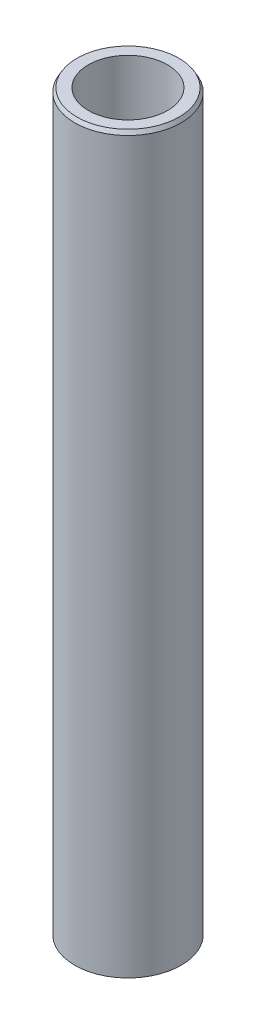
ISO-10303-21;
HEADER;
FILE_DESCRIPTION(('STEP AP214'),'2;1');
FILE_NAME('part.step','',(''),(''),'','','');
FILE_SCHEMA(('AUTOMOTIVE_DESIGN { 1 0 10303 214 1 1 1 1 }'));
ENDSEC;
DATA;
#1=APPLICATION_CONTEXT('core data for automotive mechanical design processes');
#2=APPLICATION_PROTOCOL_DEFINITION('international standard','automotive_design',2000,#1);
#3=PRODUCT_CONTEXT('',#1,'mechanical');
#4=PRODUCT('Part','Part','',(#3));
#5=PRODUCT_RELATED_PRODUCT_CATEGORY('part','',(#4));
#6=PRODUCT_DEFINITION_FORMATION('','',#4);
#7=PRODUCT_DEFINITION_CONTEXT('part definition',#1,'design');
#8=PRODUCT_DEFINITION('design','',#6,#7);
#9=PRODUCT_DEFINITION_SHAPE('','',#8);
#10=(LENGTH_UNIT() NAMED_UNIT(*) SI_UNIT(.MILLI.,.METRE.));
#11=(NAMED_UNIT(*) PLANE_ANGLE_UNIT() SI_UNIT($,.RADIAN.));
#12=(NAMED_UNIT(*) SI_UNIT($,.STERADIAN.) SOLID_ANGLE_UNIT());
#13=UNCERTAINTY_MEASURE_WITH_UNIT(LENGTH_MEASURE(1.E-05),#10,'distance_accuracy_value','');
#14=(GEOMETRIC_REPRESENTATION_CONTEXT(3) GLOBAL_UNCERTAINTY_ASSIGNED_CONTEXT((#13)) GLOBAL_UNIT_ASSIGNED_CONTEXT((#10,
#11,#12)) REPRESENTATION_CONTEXT('',''));
#15=CARTESIAN_POINT('',(0.,0.,0.));
#16=DIRECTION('',(0.,0.,1.));
#17=DIRECTION('',(1.,0.,0.));
#18=AXIS2_PLACEMENT_3D('',#15,#16,#17);
#19=CARTESIAN_POINT('',(0.,518.320670066875,0.));
#20=DIRECTION('',(0.,-1.,0.));
#21=DIRECTION('',(0.,0.,-1.));
#22=AXIS2_PLACEMENT_3D('',#19,#20,#21);
#23=CYLINDRICAL_SURFACE('',#22,37.5);
#24=CARTESIAN_POINT('',(0.,515.602855716314,0.));
#25=DIRECTION('',(0.,1.,0.));
#26=DIRECTION('',(0.,0.,1.));
#27=AXIS2_PLACEMENT_3D('',#24,#25,#26);
#28=CIRCLE('',#27,37.5);
#29=CARTESIAN_POINT('',(0.,515.602855716314,37.5));
#30=VERTEX_POINT('',#29);
#31=EDGE_CURVE('E50',#30,#30,#28,.F.);
#32=ORIENTED_EDGE('',*,*,#31,.T.);
#33=EDGE_LOOP('',(#32));
#34=FACE_BOUND('',#33,.T.);
#35=CARTESIAN_POINT('',(0.,1.56913084690324,0.));
#36=DIRECTION('',(0.,1.,0.));
#37=DIRECTION('',(0.,0.,1.));
#38=AXIS2_PLACEMENT_3D('',#35,#36,#37);
#39=CIRCLE('',#38,37.5);
#40=CARTESIAN_POINT('',(0.,1.56913084690324,37.5));
#41=VERTEX_POINT('',#40);
#42=EDGE_CURVE('E51',#41,#41,#39,.T.);
#43=ORIENTED_EDGE('',*,*,#42,.T.);
#44=EDGE_LOOP('',(#43));
#45=FACE_BOUND('',#44,.T.);
#46=ADVANCED_FACE('F39',(#34,#45),#23,.T.);
#47=CARTESIAN_POINT('',(0.,518.320670066875,0.));
#48=DIRECTION('',(0.,1.,0.));
#49=DIRECTION('',(0.,0.,1.));
#50=AXIS2_PLACEMENT_3D('',#47,#48,#49);
#51=PLANE('',#50);
#52=CARTESIAN_POINT('',(0.,518.320670066875,0.));
#53=DIRECTION('',(0.,1.,0.));
#54=DIRECTION('',(0.,0.,1.));
#55=AXIS2_PLACEMENT_3D('',#52,#53,#54);
#56=CIRCLE('',#55,35.9308691530967);
#57=CARTESIAN_POINT('',(0.,518.320670066875,35.9308691530967));
#58=VERTEX_POINT('',#57);
#59=EDGE_CURVE('E54',#58,#58,#56,.T.);
#60=ORIENTED_EDGE('',*,*,#59,.T.);
#61=EDGE_LOOP('',(#60));
#62=FACE_BOUND('',#61,.T.);
#63=CARTESIAN_POINT('',(0.,518.320670066875,0.));
#64=DIRECTION('',(0.,1.,0.));
#65=DIRECTION('',(0.,0.,1.));
#66=AXIS2_PLACEMENT_3D('',#63,#64,#65);
#67=CIRCLE('',#66,27.924179859783);
#68=CARTESIAN_POINT('',(0.,518.320670066875,27.924179859783));
#69=VERTEX_POINT('',#68);
#70=EDGE_CURVE('E58',#69,#69,#67,.T.);
#71=ORIENTED_EDGE('',*,*,#70,.F.);
#72=EDGE_LOOP('',(#71));
#73=FACE_BOUND('',#72,.T.);
#74=ADVANCED_FACE('F69',(#62,#73),#51,.T.);
#75=CARTESIAN_POINT('',(0.,0.,0.));
#76=DIRECTION('',(0.,1.,0.));
#77=DIRECTION('',(0.,0.,1.));
#78=AXIS2_PLACEMENT_3D('',#75,#76,#77);
#79=PLANE('',#78);
#80=CARTESIAN_POINT('',(0.,0.,0.));
#81=DIRECTION('',(0.,1.,0.));
#82=DIRECTION('',(0.,0.,1.));
#83=AXIS2_PLACEMENT_3D('',#80,#81,#82);
#84=CIRCLE('',#83,34.78218564944);
#85=CARTESIAN_POINT('',(0.,0.,34.78218564944));
#86=VERTEX_POINT('',#85);
#87=EDGE_CURVE('E10',#86,#86,#84,.F.);
#88=ORIENTED_EDGE('',*,*,#87,.T.);
#89=EDGE_LOOP('',(#88));
#90=FACE_BOUND('',#89,.T.);
#91=CARTESIAN_POINT('',(0.,0.,0.));
#92=DIRECTION('',(0.,1.,0.));
#93=DIRECTION('',(0.,0.,1.));
#94=AXIS2_PLACEMENT_3D('',#91,#92,#93);
#95=CIRCLE('',#94,27.924179859783);
#96=CARTESIAN_POINT('',(0.,0.,27.924179859783));
#97=VERTEX_POINT('',#96);
#98=EDGE_CURVE('E63',#97,#97,#95,.T.);
#99=ORIENTED_EDGE('',*,*,#98,.T.);
#100=EDGE_LOOP('',(#99));
#101=FACE_BOUND('',#100,.T.);
#102=ADVANCED_FACE('F75',(#90,#101),#79,.F.);
#103=CARTESIAN_POINT('',(0.,518.320670066875,0.));
#104=DIRECTION('',(0.,-1.,0.));
#105=DIRECTION('',(0.,0.,-1.));
#106=AXIS2_PLACEMENT_3D('',#103,#104,#105);
#107=CYLINDRICAL_SURFACE('',#106,27.924179859783);
#108=ORIENTED_EDGE('',*,*,#70,.T.);
#109=EDGE_LOOP('',(#108));
#110=FACE_BOUND('',#109,.T.);
#111=ORIENTED_EDGE('',*,*,#98,.F.);
#112=EDGE_LOOP('',(#111));
#113=FACE_BOUND('',#112,.T.);
#114=ADVANCED_FACE('F70',(#110,#113),#107,.F.);
#115=CARTESIAN_POINT('',(0.,518.320670066875,0.));
#116=DIRECTION('',(0.,-1.,0.));
#117=DIRECTION('',(0.,0.,-1.));
#118=AXIS2_PLACEMENT_3D('',#115,#116,#117);
#119=CONICAL_SURFACE('',#118,35.9308691530967,0.523598775598294);
#120=ORIENTED_EDGE('',*,*,#31,.F.);
#121=EDGE_LOOP('',(#120));
#122=FACE_BOUND('',#121,.T.);
#123=ORIENTED_EDGE('',*,*,#59,.F.);
#124=EDGE_LOOP('',(#123));
#125=FACE_BOUND('',#124,.T.);
#126=ADVANCED_FACE('F81',(#122,#125),#119,.T.);
#127=CARTESIAN_POINT('',(0.,1.56913084690324,0.));
#128=DIRECTION('',(0.,1.,0.));
#129=DIRECTION('',(0.,0.,1.));
#130=AXIS2_PLACEMENT_3D('',#127,#128,#129);
#131=CONICAL_SURFACE('',#130,37.5,1.0471975511966);
#132=CARTESIAN_POINT('',(0.,0.,34.78218564944));
#133=CARTESIAN_POINT('',(0.,0.0163451129885766,34.8104962155916));
#134=CARTESIAN_POINT('',(0.,0.0326902259771516,34.8388067817433));
#135=CARTESIAN_POINT('',(0.,0.0653804519543017,34.8954279140466));
#136=CARTESIAN_POINT('',(0.,0.0817255649428767,34.9237384801983));
#137=CARTESIAN_POINT('',(0.,0.114415790920027,34.9803596125016));
#138=CARTESIAN_POINT('',(0.,0.130760903908603,35.0086701786533));
#139=CARTESIAN_POINT('',(0.,0.163451129885755,35.0652913109566));
#140=CARTESIAN_POINT('',(0.,0.179796242874331,35.0936018771083));
#141=CARTESIAN_POINT('',(0.,0.212486468851481,35.1502230094116));
#142=CARTESIAN_POINT('',(0.,0.228831581840056,35.1785335755633));
#143=CARTESIAN_POINT('',(0.,0.261521807817207,35.2351547078666));
#144=CARTESIAN_POINT('',(0.,0.277866920805783,35.2634652740183));
#145=CARTESIAN_POINT('',(0.,0.310557146782934,35.3200864063216));
#146=CARTESIAN_POINT('',(0.,0.326902259771509,35.3483969724733));
#147=CARTESIAN_POINT('',(0.,0.359592485748659,35.4050181047766));
#148=CARTESIAN_POINT('',(0.,0.375937598737235,35.4333286709283));
#149=CARTESIAN_POINT('',(0.,0.408627824714387,35.4899498032316));
#150=CARTESIAN_POINT('',(0.,0.424972937702962,35.5182603693833));
#151=CARTESIAN_POINT('',(0.,0.457663163680113,35.5748815016866));
#152=CARTESIAN_POINT('',(0.,0.474008276668688,35.6031920678383));
#153=CARTESIAN_POINT('',(0.,0.506698502645838,35.6598132001416));
#154=CARTESIAN_POINT('',(0.,0.523043615634414,35.6881237662933));
#155=CARTESIAN_POINT('',(0.,0.555733841611566,35.7447448985966));
#156=CARTESIAN_POINT('',(0.,0.572078954600141,35.7730554647483));
#157=CARTESIAN_POINT('',(0.,0.604769180577292,35.8296765970517));
#158=CARTESIAN_POINT('',(0.,0.621114293565867,35.8579871632033));
#159=CARTESIAN_POINT('',(0.,0.653804519543018,35.9146082955066));
#160=CARTESIAN_POINT('',(0.,0.670149632531594,35.9429188616583));
#161=CARTESIAN_POINT('',(0.,0.702839858508745,35.9995399939617));
#162=CARTESIAN_POINT('',(0.,0.71918497149732,36.0278505601133));
#163=CARTESIAN_POINT('',(0.,0.75187519747447,36.0844716924166));
#164=CARTESIAN_POINT('',(0.,0.768220310463046,36.1127822585683));
#165=CARTESIAN_POINT('',(0.,0.800910536440197,36.1694033908717));
#166=CARTESIAN_POINT('',(0.,0.817255649428773,36.1977139570233));
#167=CARTESIAN_POINT('',(0.,0.849945875405924,36.2543350893267));
#168=CARTESIAN_POINT('',(0.,0.866290988394499,36.2826456554783));
#169=CARTESIAN_POINT('',(0.,0.898981214371649,36.3392667877817));
#170=CARTESIAN_POINT('',(0.,0.915326327360225,36.3675773539333));
#171=CARTESIAN_POINT('',(0.,0.948016553337377,36.4241984862367));
#172=CARTESIAN_POINT('',(0.,0.964361666325953,36.4525090523883));
#173=CARTESIAN_POINT('',(0.,0.997051892303103,36.5091301846917));
#174=CARTESIAN_POINT('',(0.,1.01339700529168,36.5374407508433));
#175=CARTESIAN_POINT('',(0.,1.04608723126883,36.5940618831467));
#176=CARTESIAN_POINT('',(0.,1.06243234425741,36.6223724492983));
#177=CARTESIAN_POINT('',(0.,1.09512257023456,36.6789935816017));
#178=CARTESIAN_POINT('',(0.,1.11146768322313,36.7073041477533));
#179=CARTESIAN_POINT('',(0.,1.14415790920028,36.7639252800567));
#180=CARTESIAN_POINT('',(0.,1.16050302218886,36.7922358462083));
#181=CARTESIAN_POINT('',(0.,1.19319324816601,36.8488569785117));
#182=CARTESIAN_POINT('',(0.,1.20953836115458,36.8771675446633));
#183=CARTESIAN_POINT('',(0.,1.24222858713173,36.9337886769667));
#184=CARTESIAN_POINT('',(0.,1.25857370012031,36.9620992431183));
#185=CARTESIAN_POINT('',(0.,1.29126392609746,37.0187203754217));
#186=CARTESIAN_POINT('',(0.,1.30760903908604,37.0470309415733));
#187=CARTESIAN_POINT('',(0.,1.34029926506319,37.1036520738767));
#188=CARTESIAN_POINT('',(0.,1.35664437805176,37.1319626400283));
#189=CARTESIAN_POINT('',(0.,1.38933460402891,37.1885837723317));
#190=CARTESIAN_POINT('',(0.,1.40567971701749,37.2168943384833));
#191=CARTESIAN_POINT('',(0.,1.43836994299464,37.2735154707867));
#192=CARTESIAN_POINT('',(0.,1.45471505598322,37.3018260369383));
#193=CARTESIAN_POINT('',(0.,1.48740528196037,37.3584471692417));
#194=CARTESIAN_POINT('',(0.,1.50375039494894,37.3867577353933));
#195=CARTESIAN_POINT('',(0.,1.53644062092609,37.4433788676967));
#196=CARTESIAN_POINT('',(0.,1.55278573391467,37.4716894338483));
#197=CARTESIAN_POINT('',(0.,1.56913084690324,37.5));
#198=B_SPLINE_CURVE_WITH_KNOTS('',3,(#132,#133,#134,#135,#136,#137,#138,#139,#140,#141,#142,
#143,#144,#145,#146,#147,#148,#149,#150,#151,#152,#153,#154,#155,#156,#157,#158,#159,#160,#161,
#162,#163,#164,#165,#166,#167,#168,#169,#170,#171,#172,#173,#174,#175,#176,#177,#178,#179,#180,
#181,#182,#183,#184,#185,#186,#187,#188,#189,#190,#191,#192,#193,#194,#195,#196,#197),
.UNSPECIFIED.,.F.,.F.,(4,2,2,2,2,2,2,2,2,2,2,2,2,2,2,2,2,2,2,2,2,2,2,2,2,2,2,2,2,2,2,2,4),(0.,
0.0980706779314515,0.196141355862909,0.294212033794361,0.392282711725812,0.49035338965727,
0.588424067588721,0.686494745520179,0.78456542345163,0.882636101383082,0.980706779314539,
1.07877745724599,1.17684813517744,1.2749188131089,1.37298949104035,1.47106016897181,
1.56913084690326,1.66720152483471,1.76527220276617,1.86334288069762,1.96141355862907,
2.05948423656053,2.15755491449198,2.25562559242344,2.35369627035489,2.45176694828634,
2.5498376262178,2.64790830414925,2.7459789820807,2.84404966001216,2.94212033794361,
3.04019101587507,3.13826169380652),.UNSPECIFIED.);
#199=EDGE_CURVE('BSEAM45',#86,#41,#198,.T.);
#200=ORIENTED_EDGE('',*,*,#87,.F.);
#201=ORIENTED_EDGE('',*,*,#42,.F.);
#202=ORIENTED_EDGE('',*,*,#199,.T.);
#203=ORIENTED_EDGE('',*,*,#199,.F.);
#204=EDGE_LOOP('',(#200,#202,#201,#203));
#205=FACE_BOUND('',#204,.T.);
#206=ADVANCED_FACE('F45',(#205),#131,.T.);
#207=CLOSED_SHELL('',(#46,#74,#102,#114,#126,#206));
#208=MANIFOLD_SOLID_BREP('B2',#207);
#209=ADVANCED_BREP_SHAPE_REPRESENTATION('',(#18,#208),#14);
#210=SHAPE_DEFINITION_REPRESENTATION(#9,#209);
ENDSEC;
END-ISO-10303-21;
